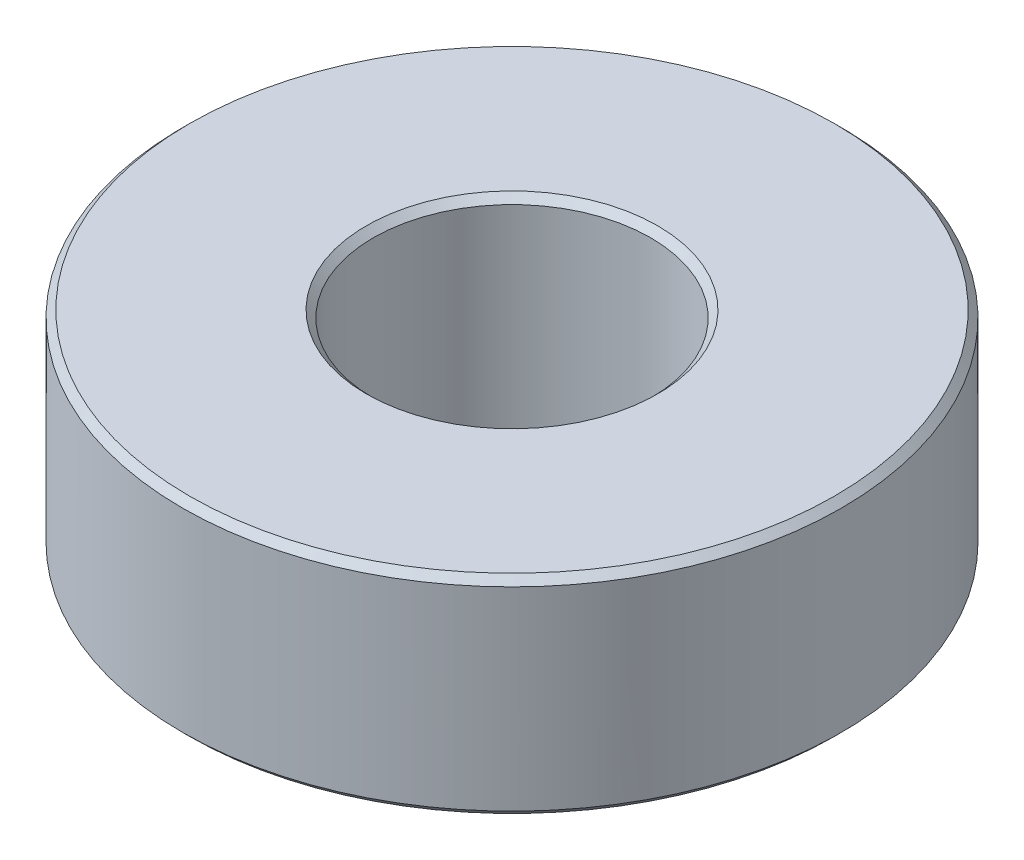
ISO-10303-21;
HEADER;
FILE_DESCRIPTION(('STEP AP214'),'2;1');
FILE_NAME('part.step','',(''),(''),'','','');
FILE_SCHEMA(('AUTOMOTIVE_DESIGN { 1 0 10303 214 1 1 1 1 }'));
ENDSEC;
DATA;
#1=APPLICATION_CONTEXT('core data for automotive mechanical design processes');
#2=APPLICATION_PROTOCOL_DEFINITION('international standard','automotive_design',2000,#1);
#3=PRODUCT_CONTEXT('',#1,'mechanical');
#4=PRODUCT('Part','Part','',(#3));
#5=PRODUCT_RELATED_PRODUCT_CATEGORY('part','',(#4));
#6=PRODUCT_DEFINITION_FORMATION('','',#4);
#7=PRODUCT_DEFINITION_CONTEXT('part definition',#1,'design');
#8=PRODUCT_DEFINITION('design','',#6,#7);
#9=PRODUCT_DEFINITION_SHAPE('','',#8);
#10=(LENGTH_UNIT() NAMED_UNIT(*) SI_UNIT(.MILLI.,.METRE.));
#11=(NAMED_UNIT(*) PLANE_ANGLE_UNIT() SI_UNIT($,.RADIAN.));
#12=(NAMED_UNIT(*) SI_UNIT($,.STERADIAN.) SOLID_ANGLE_UNIT());
#13=UNCERTAINTY_MEASURE_WITH_UNIT(LENGTH_MEASURE(1.E-05),#10,'distance_accuracy_value','');
#14=(GEOMETRIC_REPRESENTATION_CONTEXT(3) GLOBAL_UNCERTAINTY_ASSIGNED_CONTEXT((#13)) GLOBAL_UNIT_ASSIGNED_CONTEXT((#10,
#11,#12)) REPRESENTATION_CONTEXT('',''));
#15=CARTESIAN_POINT('',(0.,0.,0.));
#16=DIRECTION('',(0.,0.,1.));
#17=DIRECTION('',(1.,0.,0.));
#18=AXIS2_PLACEMENT_3D('',#15,#16,#17);
#19=CARTESIAN_POINT('',(0.,6.,0.));
#20=DIRECTION('',(0.,1.,0.));
#21=DIRECTION('',(0.,0.,1.));
#22=AXIS2_PLACEMENT_3D('',#19,#20,#21);
#23=CYLINDRICAL_SURFACE('',#22,4.);
#24=CARTESIAN_POINT('',(0.,0.199999999949796,0.));
#25=DIRECTION('',(0.,-1.,0.));
#26=DIRECTION('',(0.,0.,-1.));
#27=AXIS2_PLACEMENT_3D('',#24,#25,#26);
#28=CIRCLE('',#27,4.0000000000191);
#29=CARTESIAN_POINT('',(0.,0.199999999949796,-4.0000000000191));
#30=VERTEX_POINT('',#29);
#31=EDGE_CURVE('E36',#30,#30,#28,.T.);
#32=ORIENTED_EDGE('',*,*,#31,.T.);
#33=EDGE_LOOP('',(#32));
#34=FACE_BOUND('',#33,.T.);
#35=CARTESIAN_POINT('',(0.,5.79999999996517,0.));
#36=DIRECTION('',(0.,1.,0.));
#37=DIRECTION('',(0.,0.,1.));
#38=AXIS2_PLACEMENT_3D('',#35,#36,#37);
#39=CIRCLE('',#38,4.00000000007594);
#40=CARTESIAN_POINT('',(0.,5.79999999996517,4.00000000007594));
#41=VERTEX_POINT('',#40);
#42=EDGE_CURVE('E39',#41,#41,#39,.T.);
#43=ORIENTED_EDGE('',*,*,#42,.T.);
#44=EDGE_LOOP('',(#43));
#45=FACE_BOUND('',#44,.T.);
#46=ADVANCED_FACE('F17',(#34,#45),#23,.F.);
#47=CARTESIAN_POINT('',(0.,5.99999999985812,0.));
#48=DIRECTION('',(0.,1.,0.));
#49=DIRECTION('',(0.,0.,1.));
#50=AXIS2_PLACEMENT_3D('',#47,#48,#49);
#51=CONICAL_SURFACE('',#50,4.1999999999689,0.785398163397448);
#52=CARTESIAN_POINT('',(0.,5.99999999991496,0.));
#53=DIRECTION('',(0.,1.,0.));
#54=DIRECTION('',(0.,0.,1.));
#55=AXIS2_PLACEMENT_3D('',#52,#53,#54);
#56=CIRCLE('',#55,4.20000000002574);
#57=CARTESIAN_POINT('',(0.,5.99999999991496,4.20000000002574));
#58=VERTEX_POINT('',#57);
#59=EDGE_CURVE('E20',#58,#58,#56,.F.);
#60=ORIENTED_EDGE('',*,*,#59,.F.);
#61=EDGE_LOOP('',(#60));
#62=FACE_BOUND('',#61,.T.);
#63=ORIENTED_EDGE('',*,*,#42,.F.);
#64=EDGE_LOOP('',(#63));
#65=FACE_BOUND('',#64,.T.);
#66=ADVANCED_FACE('F60',(#62,#65),#51,.F.);
#67=CARTESIAN_POINT('',(0.,0.,0.));
#68=DIRECTION('',(0.,-1.,0.));
#69=DIRECTION('',(0.,0.,-1.));
#70=AXIS2_PLACEMENT_3D('',#67,#68,#69);
#71=CONICAL_SURFACE('',#70,4.1999999999689,0.785398163397448);
#72=ORIENTED_EDGE('',*,*,#31,.F.);
#73=EDGE_LOOP('',(#72));
#74=FACE_BOUND('',#73,.T.);
#75=CARTESIAN_POINT('',(0.,0.,0.));
#76=DIRECTION('',(0.,-1.,0.));
#77=DIRECTION('',(0.,0.,-1.));
#78=AXIS2_PLACEMENT_3D('',#75,#76,#77);
#79=CIRCLE('',#78,4.1999999999689);
#80=CARTESIAN_POINT('',(0.,0.,-4.1999999999689));
#81=VERTEX_POINT('',#80);
#82=EDGE_CURVE('E50',#81,#81,#79,.T.);
#83=ORIENTED_EDGE('',*,*,#82,.T.);
#84=EDGE_LOOP('',(#83));
#85=FACE_BOUND('',#84,.T.);
#86=ADVANCED_FACE('F63',(#74,#85),#71,.F.);
#87=CARTESIAN_POINT('',(0.,6.,0.));
#88=DIRECTION('',(0.,1.,0.));
#89=DIRECTION('',(0.,0.,1.));
#90=AXIS2_PLACEMENT_3D('',#87,#88,#89);
#91=PLANE('',#90);
#92=ORIENTED_EDGE('',*,*,#59,.T.);
#93=EDGE_LOOP('',(#92));
#94=FACE_BOUND('',#93,.T.);
#95=CARTESIAN_POINT('',(0.,6.,0.));
#96=DIRECTION('',(0.,-1.,0.));
#97=DIRECTION('',(1.,0.,0.));
#98=AXIS2_PLACEMENT_3D('',#95,#96,#97);
#99=CIRCLE('',#98,9.3);
#100=CARTESIAN_POINT('',(9.3,6.,0.));
#101=VERTEX_POINT('',#100);
#102=EDGE_CURVE('E48',#101,#101,#99,.T.);
#103=ORIENTED_EDGE('',*,*,#102,.F.);
#104=EDGE_LOOP('',(#103));
#105=FACE_BOUND('',#104,.T.);
#106=ADVANCED_FACE('F57',(#94,#105),#91,.T.);
#107=CARTESIAN_POINT('',(0.,0.,0.));
#108=DIRECTION('',(0.,1.,0.));
#109=DIRECTION('',(0.,0.,1.));
#110=AXIS2_PLACEMENT_3D('',#107,#108,#109);
#111=PLANE('',#110);
#112=ORIENTED_EDGE('',*,*,#82,.F.);
#113=EDGE_LOOP('',(#112));
#114=FACE_BOUND('',#113,.T.);
#115=CARTESIAN_POINT('',(0.,0.,0.));
#116=DIRECTION('',(0.,1.,0.));
#117=DIRECTION('',(-1.,0.,0.));
#118=AXIS2_PLACEMENT_3D('',#115,#116,#117);
#119=CIRCLE('',#118,9.3);
#120=CARTESIAN_POINT('',(-9.3,0.,0.));
#121=VERTEX_POINT('',#120);
#122=EDGE_CURVE('E29',#121,#121,#119,.T.);
#123=ORIENTED_EDGE('',*,*,#122,.F.);
#124=EDGE_LOOP('',(#123));
#125=FACE_BOUND('',#124,.T.);
#126=ADVANCED_FACE('F85',(#114,#125),#111,.F.);
#127=CARTESIAN_POINT('',(0.,5.8,0.));
#128=DIRECTION('',(0.,-1.,0.));
#129=DIRECTION('',(1.,0.,0.));
#130=AXIS2_PLACEMENT_3D('',#127,#128,#129);
#131=CONICAL_SURFACE('',#130,9.5,0.78539816339745);
#132=ORIENTED_EDGE('',*,*,#102,.T.);
#133=EDGE_LOOP('',(#132));
#134=FACE_BOUND('',#133,.T.);
#135=CARTESIAN_POINT('',(0.,5.8,0.));
#136=DIRECTION('',(0.,1.,0.));
#137=DIRECTION('',(0.,0.,1.));
#138=AXIS2_PLACEMENT_3D('',#135,#136,#137);
#139=CIRCLE('',#138,9.5);
#140=CARTESIAN_POINT('',(0.,5.8,9.5));
#141=VERTEX_POINT('',#140);
#142=EDGE_CURVE('E24',#141,#141,#139,.F.);
#143=ORIENTED_EDGE('',*,*,#142,.F.);
#144=EDGE_LOOP('',(#143));
#145=FACE_BOUND('',#144,.T.);
#146=ADVANCED_FACE('F78',(#134,#145),#131,.T.);
#147=CARTESIAN_POINT('',(0.,0.2,0.));
#148=DIRECTION('',(0.,1.,0.));
#149=DIRECTION('',(-1.,0.,0.));
#150=AXIS2_PLACEMENT_3D('',#147,#148,#149);
#151=CONICAL_SURFACE('',#150,9.5,0.785398163397452);
#152=CARTESIAN_POINT('',(0.,0.2,0.));
#153=DIRECTION('',(0.,1.,0.));
#154=DIRECTION('',(0.,0.,1.));
#155=AXIS2_PLACEMENT_3D('',#152,#153,#154);
#156=CIRCLE('',#155,9.5);
#157=CARTESIAN_POINT('',(0.,0.2,9.5));
#158=VERTEX_POINT('',#157);
#159=EDGE_CURVE('E10',#158,#158,#156,.T.);
#160=ORIENTED_EDGE('',*,*,#159,.F.);
#161=EDGE_LOOP('',(#160));
#162=FACE_BOUND('',#161,.T.);
#163=ORIENTED_EDGE('',*,*,#122,.T.);
#164=EDGE_LOOP('',(#163));
#165=FACE_BOUND('',#164,.T.);
#166=ADVANCED_FACE('F73',(#162,#165),#151,.T.);
#167=CARTESIAN_POINT('',(0.,6.,0.));
#168=DIRECTION('',(0.,1.,0.));
#169=DIRECTION('',(0.,0.,1.));
#170=AXIS2_PLACEMENT_3D('',#167,#168,#169);
#171=CYLINDRICAL_SURFACE('',#170,9.5);
#172=ORIENTED_EDGE('',*,*,#159,.T.);
#173=EDGE_LOOP('',(#172));
#174=FACE_BOUND('',#173,.T.);
#175=ORIENTED_EDGE('',*,*,#142,.T.);
#176=EDGE_LOOP('',(#175));
#177=FACE_BOUND('',#176,.T.);
#178=ADVANCED_FACE('F71',(#174,#177),#171,.T.);
#179=CLOSED_SHELL('',(#46,#66,#86,#106,#126,#146,#166,#178));
#180=MANIFOLD_SOLID_BREP('B1',#179);
#181=ADVANCED_BREP_SHAPE_REPRESENTATION('',(#18,#180),#14);
#182=SHAPE_DEFINITION_REPRESENTATION(#9,#181);
ENDSEC;
END-ISO-10303-21;
